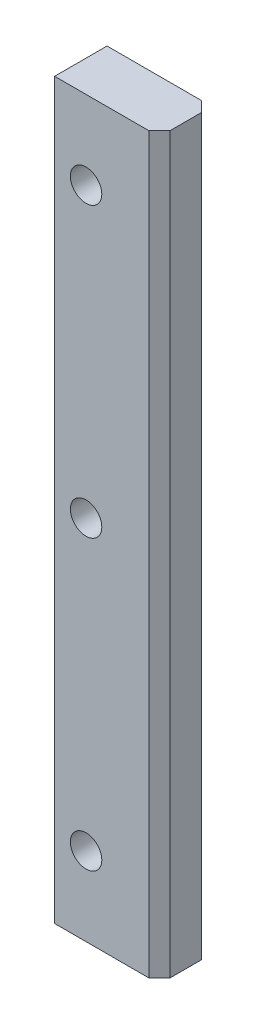
ISO-10303-21;
HEADER;
FILE_DESCRIPTION(('STEP AP214'),'2;1');
FILE_NAME('part.step','',(''),(''),'','','');
FILE_SCHEMA(('AUTOMOTIVE_DESIGN { 1 0 10303 214 1 1 1 1 }'));
ENDSEC;
DATA;
#1=APPLICATION_CONTEXT('core data for automotive mechanical design processes');
#2=APPLICATION_PROTOCOL_DEFINITION('international standard','automotive_design',2000,#1);
#3=PRODUCT_CONTEXT('',#1,'mechanical');
#4=PRODUCT('Part','Part','',(#3));
#5=PRODUCT_RELATED_PRODUCT_CATEGORY('part','',(#4));
#6=PRODUCT_DEFINITION_FORMATION('','',#4);
#7=PRODUCT_DEFINITION_CONTEXT('part definition',#1,'design');
#8=PRODUCT_DEFINITION('design','',#6,#7);
#9=PRODUCT_DEFINITION_SHAPE('','',#8);
#10=(LENGTH_UNIT() NAMED_UNIT(*) SI_UNIT(.MILLI.,.METRE.));
#11=(NAMED_UNIT(*) PLANE_ANGLE_UNIT() SI_UNIT($,.RADIAN.));
#12=(NAMED_UNIT(*) SI_UNIT($,.STERADIAN.) SOLID_ANGLE_UNIT());
#13=UNCERTAINTY_MEASURE_WITH_UNIT(LENGTH_MEASURE(1.E-05),#10,'distance_accuracy_value','');
#14=(GEOMETRIC_REPRESENTATION_CONTEXT(3) GLOBAL_UNCERTAINTY_ASSIGNED_CONTEXT((#13)) GLOBAL_UNIT_ASSIGNED_CONTEXT((#10,
#11,#12)) REPRESENTATION_CONTEXT('',''));
#15=CARTESIAN_POINT('',(0.,0.,0.));
#16=DIRECTION('',(0.,0.,1.));
#17=DIRECTION('',(1.,0.,0.));
#18=AXIS2_PLACEMENT_3D('',#15,#16,#17);
#19=CARTESIAN_POINT('',(10.,-70.,10.));
#20=DIRECTION('',(0.,1.,0.));
#21=DIRECTION('',(0.,0.,1.));
#22=AXIS2_PLACEMENT_3D('',#19,#20,#21);
#23=PLANE('',#22);
#24=DIRECTION('',(0.,0.,-1.));
#25=VECTOR('',#24,1.);
#26=CARTESIAN_POINT('',(10.,-70.,10.));
#27=LINE('',#26,#25);
#28=CARTESIAN_POINT('',(10.,-70.,8.));
#29=VERTEX_POINT('',#28);
#30=CARTESIAN_POINT('',(10.,-70.,1.99999999999999));
#31=VERTEX_POINT('',#30);
#32=EDGE_CURVE('E125',#29,#31,#27,.T.);
#33=ORIENTED_EDGE('',*,*,#32,.F.);
#34=DIRECTION('',(0.707106781186548,0.,-0.707106781186548));
#35=VECTOR('',#34,1.);
#36=CARTESIAN_POINT('',(8.00000000000004,-70.,10.));
#37=LINE('',#36,#35);
#38=CARTESIAN_POINT('',(8.00000000000004,-70.,10.));
#39=VERTEX_POINT('',#38);
#40=EDGE_CURVE('E43',#29,#39,#37,.F.);
#41=ORIENTED_EDGE('',*,*,#40,.T.);
#42=DIRECTION('',(1.,0.,0.));
#43=VECTOR('',#42,1.);
#44=CARTESIAN_POINT('',(10.,-70.,10.));
#45=LINE('',#44,#43);
#46=CARTESIAN_POINT('',(-9.99999999999995,-70.,10.));
#47=VERTEX_POINT('',#46);
#48=EDGE_CURVE('E99',#47,#39,#45,.T.);
#49=ORIENTED_EDGE('',*,*,#48,.F.);
#50=DIRECTION('',(0.,0.,-1.));
#51=VECTOR('',#50,1.);
#52=CARTESIAN_POINT('',(-9.99999999999995,-70.,10.));
#53=LINE('',#52,#51);
#54=CARTESIAN_POINT('',(-9.99999999999995,-70.,0.));
#55=VERTEX_POINT('',#54);
#56=EDGE_CURVE('E108',#47,#55,#53,.T.);
#57=ORIENTED_EDGE('',*,*,#56,.T.);
#58=DIRECTION('',(1.,0.,0.));
#59=VECTOR('',#58,1.);
#60=CARTESIAN_POINT('',(10.,-70.,0.));
#61=LINE('',#60,#59);
#62=CARTESIAN_POINT('',(8.00000000000004,-70.,0.));
#63=VERTEX_POINT('',#62);
#64=EDGE_CURVE('E117',#55,#63,#61,.T.);
#65=ORIENTED_EDGE('',*,*,#64,.T.);
#66=DIRECTION('',(0.70710678118655,0.,0.707106781186545));
#67=VECTOR('',#66,1.);
#68=CARTESIAN_POINT('',(10.,-70.,1.99999999999997));
#69=LINE('',#68,#67);
#70=EDGE_CURVE('E55',#63,#31,#69,.T.);
#71=ORIENTED_EDGE('',*,*,#70,.T.);
#72=EDGE_LOOP('',(#33,#41,#49,#57,#65,#71));
#73=FACE_BOUND('',#72,.T.);
#74=ADVANCED_FACE('F34',(#73),#23,.F.);
#75=CARTESIAN_POINT('',(10.,70.,10.));
#76=DIRECTION('',(-1.,0.,0.));
#77=DIRECTION('',(0.,-1.,0.));
#78=AXIS2_PLACEMENT_3D('',#75,#76,#77);
#79=PLANE('',#78);
#80=DIRECTION('',(0.,0.,-1.));
#81=VECTOR('',#80,1.);
#82=CARTESIAN_POINT('',(10.,70.,10.));
#83=LINE('',#82,#81);
#84=CARTESIAN_POINT('',(10.,70.,8.));
#85=VERTEX_POINT('',#84);
#86=CARTESIAN_POINT('',(10.,70.,1.99999999999999));
#87=VERTEX_POINT('',#86);
#88=EDGE_CURVE('E107',#85,#87,#83,.T.);
#89=ORIENTED_EDGE('',*,*,#88,.F.);
#90=DIRECTION('',(0.,-1.,0.));
#91=VECTOR('',#90,1.);
#92=CARTESIAN_POINT('',(10.,70.,8.));
#93=LINE('',#92,#91);
#94=EDGE_CURVE('E135',#85,#29,#93,.T.);
#95=ORIENTED_EDGE('',*,*,#94,.T.);
#96=ORIENTED_EDGE('',*,*,#32,.T.);
#97=DIRECTION('',(0.,1.,0.));
#98=VECTOR('',#97,1.);
#99=CARTESIAN_POINT('',(10.,70.,1.99999999999999));
#100=LINE('',#99,#98);
#101=EDGE_CURVE('E132',#31,#87,#100,.T.);
#102=ORIENTED_EDGE('',*,*,#101,.T.);
#103=EDGE_LOOP('',(#89,#95,#96,#102));
#104=FACE_BOUND('',#103,.T.);
#105=ADVANCED_FACE('F143',(#104),#79,.F.);
#106=CARTESIAN_POINT('',(-9.99999999999995,70.,10.));
#107=DIRECTION('',(0.,-1.,0.));
#108=DIRECTION('',(0.,0.,-1.));
#109=AXIS2_PLACEMENT_3D('',#106,#107,#108);
#110=PLANE('',#109);
#111=DIRECTION('',(-1.,0.,0.));
#112=VECTOR('',#111,1.);
#113=CARTESIAN_POINT('',(-9.99999999999995,70.,10.));
#114=LINE('',#113,#112);
#115=CARTESIAN_POINT('',(8.00000000000001,70.,10.));
#116=VERTEX_POINT('',#115);
#117=CARTESIAN_POINT('',(-9.99999999999995,70.,10.));
#118=VERTEX_POINT('',#117);
#119=EDGE_CURVE('E89',#116,#118,#114,.T.);
#120=ORIENTED_EDGE('',*,*,#119,.F.);
#121=DIRECTION('',(-0.707106781186548,0.,0.707106781186548));
#122=VECTOR('',#121,1.);
#123=CARTESIAN_POINT('',(8.00000000000002,70.,9.99999999999999));
#124=LINE('',#123,#122);
#125=EDGE_CURVE('E130',#116,#85,#124,.F.);
#126=ORIENTED_EDGE('',*,*,#125,.T.);
#127=ORIENTED_EDGE('',*,*,#88,.T.);
#128=DIRECTION('',(-0.70710678118655,0.,-0.707106781186545));
#129=VECTOR('',#128,1.);
#130=CARTESIAN_POINT('',(10.,70.,1.99999999999999));
#131=LINE('',#130,#129);
#132=CARTESIAN_POINT('',(8.00000000000001,70.,0.));
#133=VERTEX_POINT('',#132);
#134=EDGE_CURVE('E128',#87,#133,#131,.T.);
#135=ORIENTED_EDGE('',*,*,#134,.T.);
#136=DIRECTION('',(-1.,0.,0.));
#137=VECTOR('',#136,1.);
#138=CARTESIAN_POINT('',(-9.99999999999995,70.,0.));
#139=LINE('',#138,#137);
#140=CARTESIAN_POINT('',(-9.99999999999995,70.,0.));
#141=VERTEX_POINT('',#140);
#142=EDGE_CURVE('E104',#133,#141,#139,.T.);
#143=ORIENTED_EDGE('',*,*,#142,.T.);
#144=DIRECTION('',(0.,0.,-1.));
#145=VECTOR('',#144,1.);
#146=CARTESIAN_POINT('',(-9.99999999999995,70.,10.));
#147=LINE('',#146,#145);
#148=EDGE_CURVE('E102',#118,#141,#147,.T.);
#149=ORIENTED_EDGE('',*,*,#148,.F.);
#150=EDGE_LOOP('',(#120,#126,#127,#135,#143,#149));
#151=FACE_BOUND('',#150,.T.);
#152=ADVANCED_FACE('F103',(#151),#110,.F.);
#153=CARTESIAN_POINT('',(-9.99999999999995,-70.,10.));
#154=DIRECTION('',(1.,0.,0.));
#155=DIRECTION('',(0.,0.,-1.));
#156=AXIS2_PLACEMENT_3D('',#153,#154,#155);
#157=PLANE('',#156);
#158=DIRECTION('',(0.,-1.,0.));
#159=VECTOR('',#158,1.);
#160=CARTESIAN_POINT('',(-9.99999999999995,-70.,0.));
#161=LINE('',#160,#159);
#162=EDGE_CURVE('E121',#141,#55,#161,.T.);
#163=ORIENTED_EDGE('',*,*,#162,.T.);
#164=ORIENTED_EDGE('',*,*,#56,.F.);
#165=DIRECTION('',(0.,-1.,0.));
#166=VECTOR('',#165,1.);
#167=CARTESIAN_POINT('',(-9.99999999999995,-70.,10.));
#168=LINE('',#167,#166);
#169=EDGE_CURVE('E94',#118,#47,#168,.T.);
#170=ORIENTED_EDGE('',*,*,#169,.F.);
#171=ORIENTED_EDGE('',*,*,#148,.T.);
#172=EDGE_LOOP('',(#163,#164,#170,#171));
#173=FACE_BOUND('',#172,.T.);
#174=ADVANCED_FACE('F110',(#173),#157,.F.);
#175=CARTESIAN_POINT('',(0.,0.,10.));
#176=DIRECTION('',(0.,0.,-1.));
#177=DIRECTION('',(-1.,0.,0.));
#178=AXIS2_PLACEMENT_3D('',#175,#176,#177);
#179=PLANE('',#178);
#180=CARTESIAN_POINT('',(-3.99999999999993,55.,10.));
#181=DIRECTION('',(0.,0.,1.));
#182=DIRECTION('',(1.,0.,0.));
#183=AXIS2_PLACEMENT_3D('',#180,#181,#182);
#184=CIRCLE('',#183,3.);
#185=CARTESIAN_POINT('',(-0.999999999999931,55.,10.));
#186=VERTEX_POINT('',#185);
#187=EDGE_CURVE('E229',#186,#186,#184,.T.);
#188=ORIENTED_EDGE('',*,*,#187,.F.);
#189=EDGE_LOOP('',(#188));
#190=FACE_BOUND('',#189,.T.);
#191=CARTESIAN_POINT('',(-3.99999999999993,0.,10.));
#192=DIRECTION('',(0.,0.,1.));
#193=DIRECTION('',(1.,0.,0.));
#194=AXIS2_PLACEMENT_3D('',#191,#192,#193);
#195=CIRCLE('',#194,3.);
#196=CARTESIAN_POINT('',(-0.99999999999993,0.,10.));
#197=VERTEX_POINT('',#196);
#198=EDGE_CURVE('E234',#197,#197,#195,.T.);
#199=ORIENTED_EDGE('',*,*,#198,.F.);
#200=EDGE_LOOP('',(#199));
#201=FACE_BOUND('',#200,.T.);
#202=CARTESIAN_POINT('',(-3.9999999999999,-55.,10.));
#203=DIRECTION('',(0.,0.,1.));
#204=DIRECTION('',(1.,0.,0.));
#205=AXIS2_PLACEMENT_3D('',#202,#203,#204);
#206=CIRCLE('',#205,3.);
#207=CARTESIAN_POINT('',(-0.999999999999898,-55.,10.));
#208=VERTEX_POINT('',#207);
#209=EDGE_CURVE('E242',#208,#208,#206,.T.);
#210=ORIENTED_EDGE('',*,*,#209,.F.);
#211=EDGE_LOOP('',(#210));
#212=FACE_BOUND('',#211,.T.);
#213=ORIENTED_EDGE('',*,*,#48,.T.);
#214=DIRECTION('',(0.,1.,0.));
#215=VECTOR('',#214,1.);
#216=CARTESIAN_POINT('',(8.00000000000003,0.,10.));
#217=LINE('',#216,#215);
#218=EDGE_CURVE('E97',#39,#116,#217,.T.);
#219=ORIENTED_EDGE('',*,*,#218,.T.);
#220=ORIENTED_EDGE('',*,*,#119,.T.);
#221=ORIENTED_EDGE('',*,*,#169,.T.);
#222=EDGE_LOOP('',(#213,#219,#220,#221));
#223=FACE_BOUND('',#222,.T.);
#224=ADVANCED_FACE('F92',(#190,#201,#212,#223),#179,.F.);
#225=CARTESIAN_POINT('',(0.,0.,0.));
#226=DIRECTION('',(0.,0.,-1.));
#227=DIRECTION('',(-1.,0.,0.));
#228=AXIS2_PLACEMENT_3D('',#225,#226,#227);
#229=PLANE('',#228);
#230=CARTESIAN_POINT('',(-3.99999999999993,55.,0.));
#231=DIRECTION('',(0.,0.,1.));
#232=DIRECTION('',(1.,0.,0.));
#233=AXIS2_PLACEMENT_3D('',#230,#231,#232);
#234=CIRCLE('',#233,3.);
#235=CARTESIAN_POINT('',(-0.999999999999931,55.,0.));
#236=VERTEX_POINT('',#235);
#237=EDGE_CURVE('E119',#236,#236,#234,.T.);
#238=ORIENTED_EDGE('',*,*,#237,.T.);
#239=EDGE_LOOP('',(#238));
#240=FACE_BOUND('',#239,.T.);
#241=CARTESIAN_POINT('',(-3.99999999999993,0.,0.));
#242=DIRECTION('',(0.,0.,1.));
#243=DIRECTION('',(1.,0.,0.));
#244=AXIS2_PLACEMENT_3D('',#241,#242,#243);
#245=CIRCLE('',#244,3.);
#246=CARTESIAN_POINT('',(-0.99999999999993,0.,0.));
#247=VERTEX_POINT('',#246);
#248=EDGE_CURVE('E230',#247,#247,#245,.T.);
#249=ORIENTED_EDGE('',*,*,#248,.T.);
#250=EDGE_LOOP('',(#249));
#251=FACE_BOUND('',#250,.T.);
#252=CARTESIAN_POINT('',(-3.9999999999999,-55.,0.));
#253=DIRECTION('',(0.,0.,1.));
#254=DIRECTION('',(1.,0.,0.));
#255=AXIS2_PLACEMENT_3D('',#252,#253,#254);
#256=CIRCLE('',#255,3.);
#257=CARTESIAN_POINT('',(-0.999999999999898,-55.,0.));
#258=VERTEX_POINT('',#257);
#259=EDGE_CURVE('E239',#258,#258,#256,.T.);
#260=ORIENTED_EDGE('',*,*,#259,.T.);
#261=EDGE_LOOP('',(#260));
#262=FACE_BOUND('',#261,.T.);
#263=ORIENTED_EDGE('',*,*,#142,.F.);
#264=DIRECTION('',(0.,-1.,0.));
#265=VECTOR('',#264,1.);
#266=CARTESIAN_POINT('',(8.00000000000004,-70.,0.));
#267=LINE('',#266,#265);
#268=EDGE_CURVE('E11',#133,#63,#267,.T.);
#269=ORIENTED_EDGE('',*,*,#268,.T.);
#270=ORIENTED_EDGE('',*,*,#64,.F.);
#271=ORIENTED_EDGE('',*,*,#162,.F.);
#272=EDGE_LOOP('',(#263,#269,#270,#271));
#273=FACE_BOUND('',#272,.T.);
#274=ADVANCED_FACE('F146',(#240,#251,#262,#273),#229,.T.);
#275=CARTESIAN_POINT('',(8.00000000000003,0.,10.));
#276=DIRECTION('',(-0.707106781186547,0.,-0.707106781186547));
#277=DIRECTION('',(0.,1.,0.));
#278=AXIS2_PLACEMENT_3D('',#275,#276,#277);
#279=PLANE('',#278);
#280=ORIENTED_EDGE('',*,*,#40,.F.);
#281=ORIENTED_EDGE('',*,*,#94,.F.);
#282=ORIENTED_EDGE('',*,*,#125,.F.);
#283=ORIENTED_EDGE('',*,*,#218,.F.);
#284=EDGE_LOOP('',(#280,#281,#282,#283));
#285=FACE_BOUND('',#284,.T.);
#286=ADVANCED_FACE('F140',(#285),#279,.F.);
#287=CARTESIAN_POINT('',(10.,70.,1.99999999999999));
#288=DIRECTION('',(0.707106781186545,0.,-0.70710678118655));
#289=DIRECTION('',(0.,-1.,0.));
#290=AXIS2_PLACEMENT_3D('',#287,#288,#289);
#291=PLANE('',#290);
#292=ORIENTED_EDGE('',*,*,#70,.F.);
#293=ORIENTED_EDGE('',*,*,#268,.F.);
#294=ORIENTED_EDGE('',*,*,#134,.F.);
#295=ORIENTED_EDGE('',*,*,#101,.F.);
#296=EDGE_LOOP('',(#292,#293,#294,#295));
#297=FACE_BOUND('',#296,.T.);
#298=ADVANCED_FACE('F37',(#297),#291,.T.);
#299=CARTESIAN_POINT('',(-3.9999999999999,-55.,0.));
#300=DIRECTION('',(0.,0.,1.));
#301=DIRECTION('',(1.,0.,0.));
#302=AXIS2_PLACEMENT_3D('',#299,#300,#301);
#303=CYLINDRICAL_SURFACE('',#302,3.);
#304=ORIENTED_EDGE('',*,*,#259,.F.);
#305=EDGE_LOOP('',(#304));
#306=FACE_BOUND('',#305,.T.);
#307=ORIENTED_EDGE('',*,*,#209,.T.);
#308=EDGE_LOOP('',(#307));
#309=FACE_BOUND('',#308,.T.);
#310=ADVANCED_FACE('F196',(#306,#309),#303,.F.);
#311=CARTESIAN_POINT('',(-3.99999999999993,0.,0.));
#312=DIRECTION('',(0.,0.,1.));
#313=DIRECTION('',(1.,0.,0.));
#314=AXIS2_PLACEMENT_3D('',#311,#312,#313);
#315=CYLINDRICAL_SURFACE('',#314,3.);
#316=ORIENTED_EDGE('',*,*,#248,.F.);
#317=EDGE_LOOP('',(#316));
#318=FACE_BOUND('',#317,.T.);
#319=ORIENTED_EDGE('',*,*,#198,.T.);
#320=EDGE_LOOP('',(#319));
#321=FACE_BOUND('',#320,.T.);
#322=ADVANCED_FACE('F201',(#318,#321),#315,.F.);
#323=CARTESIAN_POINT('',(-3.99999999999993,55.,0.));
#324=DIRECTION('',(0.,0.,1.));
#325=DIRECTION('',(1.,0.,0.));
#326=AXIS2_PLACEMENT_3D('',#323,#324,#325);
#327=CYLINDRICAL_SURFACE('',#326,3.);
#328=ORIENTED_EDGE('',*,*,#237,.F.);
#329=EDGE_LOOP('',(#328));
#330=FACE_BOUND('',#329,.T.);
#331=ORIENTED_EDGE('',*,*,#187,.T.);
#332=EDGE_LOOP('',(#331));
#333=FACE_BOUND('',#332,.T.);
#334=ADVANCED_FACE('F211',(#330,#333),#327,.F.);
#335=CLOSED_SHELL('',(#74,#105,#152,#174,#224,#274,#286,#298,#310,#322,#334));
#336=MANIFOLD_SOLID_BREP('B2',#335);
#337=ADVANCED_BREP_SHAPE_REPRESENTATION('',(#18,#336),#14);
#338=SHAPE_DEFINITION_REPRESENTATION(#9,#337);
ENDSEC;
END-ISO-10303-21;
